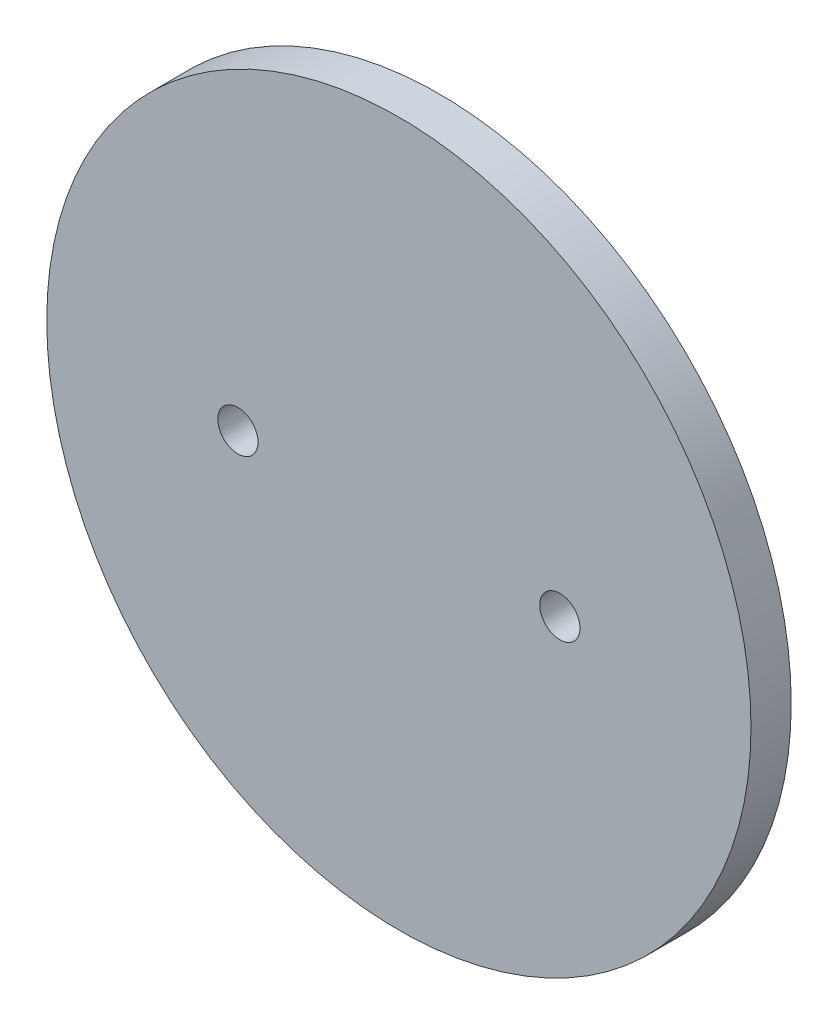
ISO-10303-21;
HEADER;
FILE_DESCRIPTION(('STEP AP214'),'2;1');
FILE_NAME('part.step','',(''),(''),'','','');
FILE_SCHEMA(('AUTOMOTIVE_DESIGN { 1 0 10303 214 1 1 1 1 }'));
ENDSEC;
DATA;
#1=APPLICATION_CONTEXT('core data for automotive mechanical design processes');
#2=APPLICATION_PROTOCOL_DEFINITION('international standard','automotive_design',2000,#1);
#3=PRODUCT_CONTEXT('',#1,'mechanical');
#4=PRODUCT('Part','Part','',(#3));
#5=PRODUCT_RELATED_PRODUCT_CATEGORY('part','',(#4));
#6=PRODUCT_DEFINITION_FORMATION('','',#4);
#7=PRODUCT_DEFINITION_CONTEXT('part definition',#1,'design');
#8=PRODUCT_DEFINITION('design','',#6,#7);
#9=PRODUCT_DEFINITION_SHAPE('','',#8);
#10=(LENGTH_UNIT() NAMED_UNIT(*) SI_UNIT(.MILLI.,.METRE.));
#11=(NAMED_UNIT(*) PLANE_ANGLE_UNIT() SI_UNIT($,.RADIAN.));
#12=(NAMED_UNIT(*) SI_UNIT($,.STERADIAN.) SOLID_ANGLE_UNIT());
#13=UNCERTAINTY_MEASURE_WITH_UNIT(LENGTH_MEASURE(1.E-05),#10,'distance_accuracy_value','');
#14=(GEOMETRIC_REPRESENTATION_CONTEXT(3) GLOBAL_UNCERTAINTY_ASSIGNED_CONTEXT((#13)) GLOBAL_UNIT_ASSIGNED_CONTEXT((#10,
#11,#12)) REPRESENTATION_CONTEXT('',''));
#15=CARTESIAN_POINT('',(0.,0.,0.));
#16=DIRECTION('',(0.,0.,1.));
#17=DIRECTION('',(1.,0.,0.));
#18=AXIS2_PLACEMENT_3D('',#15,#16,#17);
#19=CARTESIAN_POINT('',(0.,0.,2.54));
#20=DIRECTION('',(0.,0.,-1.));
#21=DIRECTION('',(-1.,0.,0.));
#22=AXIS2_PLACEMENT_3D('',#19,#20,#21);
#23=CYLINDRICAL_SURFACE('',#22,22.225);
#24=CARTESIAN_POINT('',(0.,0.,2.54));
#25=DIRECTION('',(0.,0.,1.));
#26=DIRECTION('',(1.,0.,0.));
#27=AXIS2_PLACEMENT_3D('',#24,#25,#26);
#28=CIRCLE('',#27,22.225);
#29=CARTESIAN_POINT('',(22.225,0.,2.54));
#30=VERTEX_POINT('',#29);
#31=EDGE_CURVE('E10',#30,#30,#28,.T.);
#32=ORIENTED_EDGE('',*,*,#31,.F.);
#33=EDGE_LOOP('',(#32));
#34=FACE_BOUND('',#33,.T.);
#35=CARTESIAN_POINT('',(0.,0.,0.));
#36=DIRECTION('',(0.,0.,1.));
#37=DIRECTION('',(1.,0.,0.));
#38=AXIS2_PLACEMENT_3D('',#35,#36,#37);
#39=CIRCLE('',#38,22.225);
#40=CARTESIAN_POINT('',(22.225,0.,0.));
#41=VERTEX_POINT('',#40);
#42=EDGE_CURVE('E35',#41,#41,#39,.T.);
#43=ORIENTED_EDGE('',*,*,#42,.T.);
#44=EDGE_LOOP('',(#43));
#45=FACE_BOUND('',#44,.T.);
#46=ADVANCED_FACE('F32',(#34,#45),#23,.T.);
#47=CARTESIAN_POINT('',(0.,0.,2.54));
#48=DIRECTION('',(0.,0.,1.));
#49=DIRECTION('',(1.,0.,0.));
#50=AXIS2_PLACEMENT_3D('',#47,#48,#49);
#51=PLANE('',#50);
#52=CARTESIAN_POINT('',(-10.16,0.,2.54));
#53=DIRECTION('',(0.,0.,1.));
#54=DIRECTION('',(1.,0.,0.));
#55=AXIS2_PLACEMENT_3D('',#52,#53,#54);
#56=CIRCLE('',#55,1.27);
#57=CARTESIAN_POINT('',(-8.89,0.,2.54));
#58=VERTEX_POINT('',#57);
#59=EDGE_CURVE('E50',#58,#58,#56,.T.);
#60=ORIENTED_EDGE('',*,*,#59,.F.);
#61=EDGE_LOOP('',(#60));
#62=FACE_BOUND('',#61,.T.);
#63=CARTESIAN_POINT('',(10.16,0.,2.54));
#64=DIRECTION('',(0.,0.,1.));
#65=DIRECTION('',(1.,0.,0.));
#66=AXIS2_PLACEMENT_3D('',#63,#64,#65);
#67=CIRCLE('',#66,1.27);
#68=CARTESIAN_POINT('',(11.43,0.,2.54));
#69=VERTEX_POINT('',#68);
#70=EDGE_CURVE('E44',#69,#69,#67,.T.);
#71=ORIENTED_EDGE('',*,*,#70,.F.);
#72=EDGE_LOOP('',(#71));
#73=FACE_BOUND('',#72,.T.);
#74=ORIENTED_EDGE('',*,*,#31,.T.);
#75=EDGE_LOOP('',(#74));
#76=FACE_BOUND('',#75,.T.);
#77=ADVANCED_FACE('F66',(#62,#73,#76),#51,.T.);
#78=CARTESIAN_POINT('',(0.,0.,0.));
#79=DIRECTION('',(0.,0.,1.));
#80=DIRECTION('',(1.,0.,0.));
#81=AXIS2_PLACEMENT_3D('',#78,#79,#80);
#82=PLANE('',#81);
#83=CARTESIAN_POINT('',(-10.16,0.,0.));
#84=DIRECTION('',(0.,0.,1.));
#85=DIRECTION('',(1.,0.,0.));
#86=AXIS2_PLACEMENT_3D('',#83,#84,#85);
#87=CIRCLE('',#86,1.27);
#88=CARTESIAN_POINT('',(-8.89,0.,0.));
#89=VERTEX_POINT('',#88);
#90=EDGE_CURVE('E42',#89,#89,#87,.T.);
#91=ORIENTED_EDGE('',*,*,#90,.T.);
#92=EDGE_LOOP('',(#91));
#93=FACE_BOUND('',#92,.T.);
#94=CARTESIAN_POINT('',(10.16,0.,0.));
#95=DIRECTION('',(0.,0.,1.));
#96=DIRECTION('',(1.,0.,0.));
#97=AXIS2_PLACEMENT_3D('',#94,#95,#96);
#98=CIRCLE('',#97,1.27);
#99=CARTESIAN_POINT('',(11.43,0.,0.));
#100=VERTEX_POINT('',#99);
#101=EDGE_CURVE('E47',#100,#100,#98,.T.);
#102=ORIENTED_EDGE('',*,*,#101,.T.);
#103=EDGE_LOOP('',(#102));
#104=FACE_BOUND('',#103,.T.);
#105=ORIENTED_EDGE('',*,*,#42,.F.);
#106=EDGE_LOOP('',(#105));
#107=FACE_BOUND('',#106,.T.);
#108=ADVANCED_FACE('F56',(#93,#104,#107),#82,.F.);
#109=CARTESIAN_POINT('',(10.16,0.,0.));
#110=DIRECTION('',(0.,0.,1.));
#111=DIRECTION('',(1.,0.,0.));
#112=AXIS2_PLACEMENT_3D('',#109,#110,#111);
#113=CYLINDRICAL_SURFACE('',#112,1.27);
#114=ORIENTED_EDGE('',*,*,#101,.F.);
#115=EDGE_LOOP('',(#114));
#116=FACE_BOUND('',#115,.T.);
#117=ORIENTED_EDGE('',*,*,#70,.T.);
#118=EDGE_LOOP('',(#117));
#119=FACE_BOUND('',#118,.T.);
#120=ADVANCED_FACE('F62',(#116,#119),#113,.F.);
#121=CARTESIAN_POINT('',(-10.16,0.,0.));
#122=DIRECTION('',(0.,0.,1.));
#123=DIRECTION('',(1.,0.,0.));
#124=AXIS2_PLACEMENT_3D('',#121,#122,#123);
#125=CYLINDRICAL_SURFACE('',#124,1.27);
#126=ORIENTED_EDGE('',*,*,#90,.F.);
#127=EDGE_LOOP('',(#126));
#128=FACE_BOUND('',#127,.T.);
#129=ORIENTED_EDGE('',*,*,#59,.T.);
#130=EDGE_LOOP('',(#129));
#131=FACE_BOUND('',#130,.T.);
#132=ADVANCED_FACE('F59',(#128,#131),#125,.F.);
#133=CLOSED_SHELL('',(#46,#77,#108,#120,#132));
#134=MANIFOLD_SOLID_BREP('B2',#133);
#135=ADVANCED_BREP_SHAPE_REPRESENTATION('',(#18,#134),#14);
#136=SHAPE_DEFINITION_REPRESENTATION(#9,#135);
ENDSEC;
END-ISO-10303-21;
